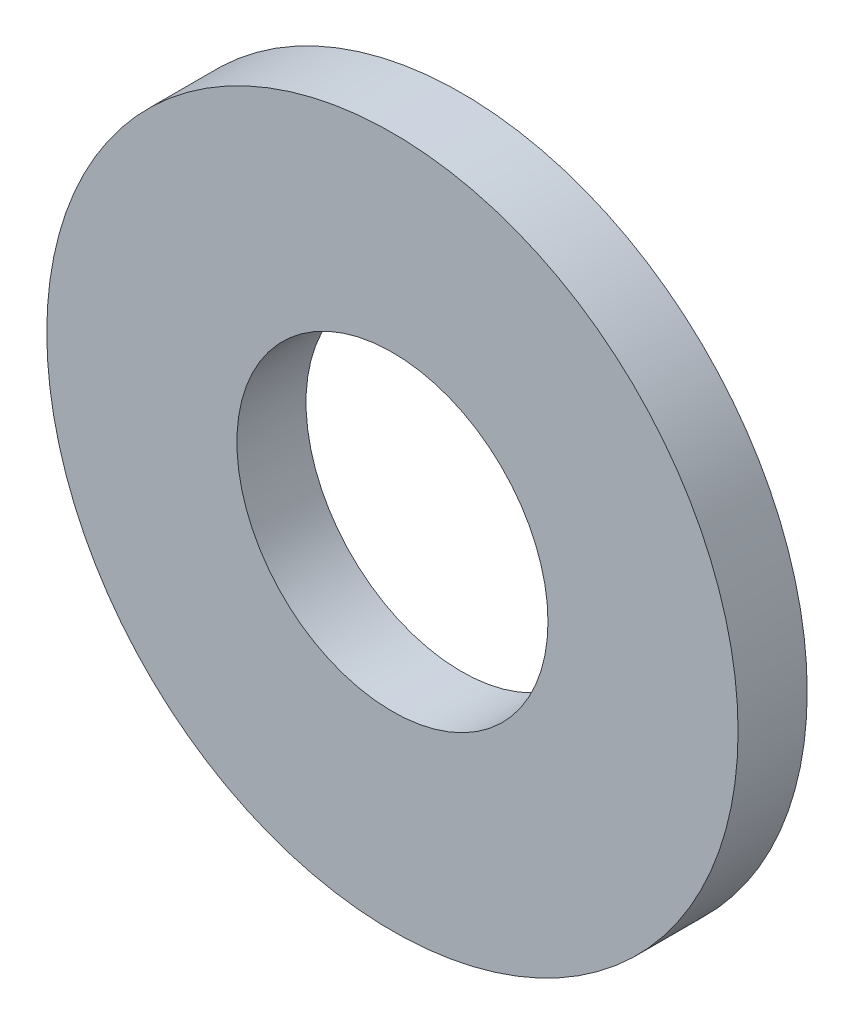
ISO-10303-21;
HEADER;
FILE_DESCRIPTION(('STEP AP214'),'2;1');
FILE_NAME('part.step','',(''),(''),'','','');
FILE_SCHEMA(('AUTOMOTIVE_DESIGN { 1 0 10303 214 1 1 1 1 }'));
ENDSEC;
DATA;
#1=APPLICATION_CONTEXT('core data for automotive mechanical design processes');
#2=APPLICATION_PROTOCOL_DEFINITION('international standard','automotive_design',2000,#1);
#3=PRODUCT_CONTEXT('',#1,'mechanical');
#4=PRODUCT('Part','Part','',(#3));
#5=PRODUCT_RELATED_PRODUCT_CATEGORY('part','',(#4));
#6=PRODUCT_DEFINITION_FORMATION('','',#4);
#7=PRODUCT_DEFINITION_CONTEXT('part definition',#1,'design');
#8=PRODUCT_DEFINITION('design','',#6,#7);
#9=PRODUCT_DEFINITION_SHAPE('','',#8);
#10=(LENGTH_UNIT() NAMED_UNIT(*) SI_UNIT(.MILLI.,.METRE.));
#11=(NAMED_UNIT(*) PLANE_ANGLE_UNIT() SI_UNIT($,.RADIAN.));
#12=(NAMED_UNIT(*) SI_UNIT($,.STERADIAN.) SOLID_ANGLE_UNIT());
#13=UNCERTAINTY_MEASURE_WITH_UNIT(LENGTH_MEASURE(1.E-05),#10,'distance_accuracy_value','');
#14=(GEOMETRIC_REPRESENTATION_CONTEXT(3) GLOBAL_UNCERTAINTY_ASSIGNED_CONTEXT((#13)) GLOBAL_UNIT_ASSIGNED_CONTEXT((#10,
#11,#12)) REPRESENTATION_CONTEXT('',''));
#15=CARTESIAN_POINT('',(0.,0.,0.));
#16=DIRECTION('',(0.,0.,1.));
#17=DIRECTION('',(1.,0.,0.));
#18=AXIS2_PLACEMENT_3D('',#15,#16,#17);
#19=CARTESIAN_POINT('',(0.,0.,0.6));
#20=DIRECTION('',(0.,0.,1.));
#21=DIRECTION('',(1.,0.,0.));
#22=AXIS2_PLACEMENT_3D('',#19,#20,#21);
#23=PLANE('',#22);
#24=CARTESIAN_POINT('',(0.,0.,0.6));
#25=DIRECTION('',(0.,0.,1.));
#26=DIRECTION('',(1.,0.,0.));
#27=AXIS2_PLACEMENT_3D('',#24,#25,#26);
#28=CIRCLE('',#27,3.);
#29=CARTESIAN_POINT('',(3.,0.,0.6));
#30=VERTEX_POINT('',#29);
#31=EDGE_CURVE('E10',#30,#30,#28,.T.);
#32=ORIENTED_EDGE('',*,*,#31,.T.);
#33=EDGE_LOOP('',(#32));
#34=FACE_BOUND('',#33,.T.);
#35=CARTESIAN_POINT('',(0.,0.,0.6));
#36=DIRECTION('',(0.,0.,1.));
#37=DIRECTION('',(1.,0.,0.));
#38=AXIS2_PLACEMENT_3D('',#35,#36,#37);
#39=CIRCLE('',#38,1.35);
#40=CARTESIAN_POINT('',(1.35,0.,0.6));
#41=VERTEX_POINT('',#40);
#42=EDGE_CURVE('E54',#41,#41,#39,.T.);
#43=ORIENTED_EDGE('',*,*,#42,.F.);
#44=EDGE_LOOP('',(#43));
#45=FACE_BOUND('',#44,.T.);
#46=ADVANCED_FACE('F41',(#34,#45),#23,.T.);
#47=CARTESIAN_POINT('',(0.,0.,0.));
#48=DIRECTION('',(0.,0.,1.));
#49=DIRECTION('',(1.,0.,0.));
#50=AXIS2_PLACEMENT_3D('',#47,#48,#49);
#51=PLANE('',#50);
#52=CARTESIAN_POINT('',(0.,0.,0.));
#53=DIRECTION('',(0.,0.,1.));
#54=DIRECTION('',(1.,0.,0.));
#55=AXIS2_PLACEMENT_3D('',#52,#53,#54);
#56=CIRCLE('',#55,3.);
#57=CARTESIAN_POINT('',(3.,0.,0.));
#58=VERTEX_POINT('',#57);
#59=EDGE_CURVE('E45',#58,#58,#56,.T.);
#60=ORIENTED_EDGE('',*,*,#59,.F.);
#61=EDGE_LOOP('',(#60));
#62=FACE_BOUND('',#61,.T.);
#63=CARTESIAN_POINT('',(0.,0.,0.));
#64=DIRECTION('',(0.,0.,1.));
#65=DIRECTION('',(1.,0.,0.));
#66=AXIS2_PLACEMENT_3D('',#63,#64,#65);
#67=CIRCLE('',#66,1.35);
#68=CARTESIAN_POINT('',(1.35,0.,0.));
#69=VERTEX_POINT('',#68);
#70=EDGE_CURVE('E56',#69,#69,#67,.T.);
#71=ORIENTED_EDGE('',*,*,#70,.T.);
#72=EDGE_LOOP('',(#71));
#73=FACE_BOUND('',#72,.T.);
#74=ADVANCED_FACE('F68',(#62,#73),#51,.F.);
#75=CARTESIAN_POINT('',(0.,0.,0.6));
#76=DIRECTION('',(0.,0.,-1.));
#77=DIRECTION('',(-1.,0.,0.));
#78=AXIS2_PLACEMENT_3D('',#75,#76,#77);
#79=CYLINDRICAL_SURFACE('',#78,3.);
#80=ORIENTED_EDGE('',*,*,#31,.F.);
#81=EDGE_LOOP('',(#80));
#82=FACE_BOUND('',#81,.T.);
#83=ORIENTED_EDGE('',*,*,#59,.T.);
#84=EDGE_LOOP('',(#83));
#85=FACE_BOUND('',#84,.T.);
#86=ADVANCED_FACE('F43',(#82,#85),#79,.T.);
#87=CARTESIAN_POINT('',(0.,0.,0.6));
#88=DIRECTION('',(0.,0.,-1.));
#89=DIRECTION('',(-1.,0.,0.));
#90=AXIS2_PLACEMENT_3D('',#87,#88,#89);
#91=CYLINDRICAL_SURFACE('',#90,1.35);
#92=ORIENTED_EDGE('',*,*,#42,.T.);
#93=EDGE_LOOP('',(#92));
#94=FACE_BOUND('',#93,.T.);
#95=ORIENTED_EDGE('',*,*,#70,.F.);
#96=EDGE_LOOP('',(#95));
#97=FACE_BOUND('',#96,.T.);
#98=ADVANCED_FACE('F64',(#94,#97),#91,.F.);
#99=CLOSED_SHELL('',(#46,#74,#86,#98));
#100=MANIFOLD_SOLID_BREP('B2',#99);
#101=ADVANCED_BREP_SHAPE_REPRESENTATION('',(#18,#100),#14);
#102=SHAPE_DEFINITION_REPRESENTATION(#9,#101);
ENDSEC;
END-ISO-10303-21;
